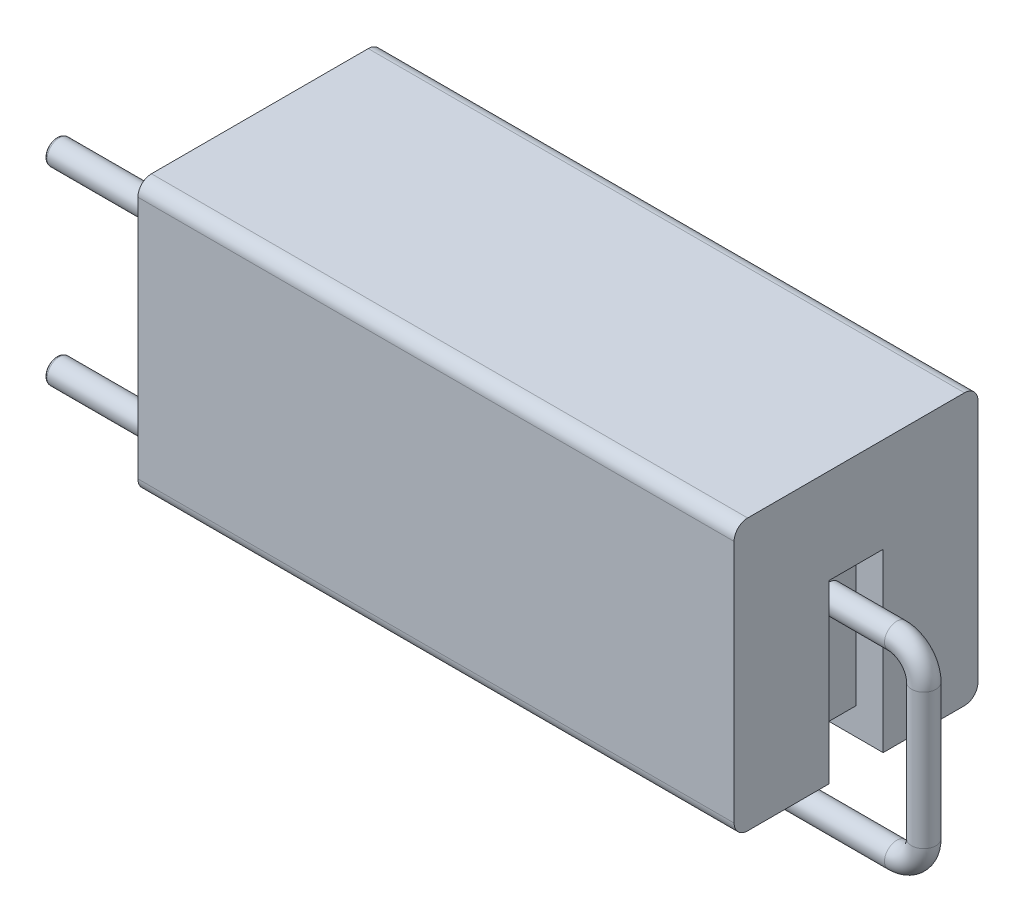
ISO-10303-21;
HEADER;
FILE_DESCRIPTION(('STEP AP214'),'2;1');
FILE_NAME('part.step','',(''),(''),'','','');
FILE_SCHEMA(('AUTOMOTIVE_DESIGN { 1 0 10303 214 1 1 1 1 }'));
ENDSEC;
DATA;
#1=APPLICATION_CONTEXT('core data for automotive mechanical design processes');
#2=APPLICATION_PROTOCOL_DEFINITION('international standard','automotive_design',2000,#1);
#3=PRODUCT_CONTEXT('',#1,'mechanical');
#4=PRODUCT('Part','Part','',(#3));
#5=PRODUCT_RELATED_PRODUCT_CATEGORY('part','',(#4));
#6=PRODUCT_DEFINITION_FORMATION('','',#4);
#7=PRODUCT_DEFINITION_CONTEXT('part definition',#1,'design');
#8=PRODUCT_DEFINITION('design','',#6,#7);
#9=PRODUCT_DEFINITION_SHAPE('','',#8);
#10=(LENGTH_UNIT() NAMED_UNIT(*) SI_UNIT(.MILLI.,.METRE.));
#11=(NAMED_UNIT(*) PLANE_ANGLE_UNIT() SI_UNIT($,.RADIAN.));
#12=(NAMED_UNIT(*) SI_UNIT($,.STERADIAN.) SOLID_ANGLE_UNIT());
#13=UNCERTAINTY_MEASURE_WITH_UNIT(LENGTH_MEASURE(1.E-05),#10,'distance_accuracy_value','');
#14=(GEOMETRIC_REPRESENTATION_CONTEXT(3) GLOBAL_UNCERTAINTY_ASSIGNED_CONTEXT((#13)) GLOBAL_UNIT_ASSIGNED_CONTEXT((#10,
#11,#12)) REPRESENTATION_CONTEXT('',''));
#15=CARTESIAN_POINT('',(0.,0.,0.));
#16=DIRECTION('',(0.,0.,1.));
#17=DIRECTION('',(1.,0.,0.));
#18=AXIS2_PLACEMENT_3D('',#15,#16,#17);
#19=CARTESIAN_POINT('',(0.,-10.,9.));
#20=DIRECTION('',(0.,1.,0.));
#21=DIRECTION('',(0.,0.,1.));
#22=AXIS2_PLACEMENT_3D('',#19,#20,#21);
#23=PLANE('',#22);
#24=DIRECTION('',(-1.,0.,0.));
#25=VECTOR('',#24,1.);
#26=CARTESIAN_POINT('',(1.,-10.,5.5));
#27=LINE('',#26,#25);
#28=CARTESIAN_POINT('',(3.,-10.,5.5));
#29=VERTEX_POINT('',#28);
#30=CARTESIAN_POINT('',(0.,-10.,5.5));
#31=VERTEX_POINT('',#30);
#32=EDGE_CURVE('E257',#29,#31,#27,.T.);
#33=ORIENTED_EDGE('',*,*,#32,.F.);
#34=DIRECTION('',(0.,0.,-1.));
#35=VECTOR('',#34,1.);
#36=CARTESIAN_POINT('',(3.,-10.,8.));
#37=LINE('',#36,#35);
#38=CARTESIAN_POINT('',(3.,-10.,8.));
#39=VERTEX_POINT('',#38);
#40=EDGE_CURVE('E413',#39,#29,#37,.T.);
#41=ORIENTED_EDGE('',*,*,#40,.F.);
#42=DIRECTION('',(-1.,0.,0.));
#43=VECTOR('',#42,1.);
#44=CARTESIAN_POINT('',(3.,-10.,8.));
#45=LINE('',#44,#43);
#46=CARTESIAN_POINT('',(19.,-10.,8.));
#47=VERTEX_POINT('',#46);
#48=EDGE_CURVE('E403',#47,#39,#45,.T.);
#49=ORIENTED_EDGE('',*,*,#48,.F.);
#50=DIRECTION('',(0.,0.,1.));
#51=VECTOR('',#50,1.);
#52=CARTESIAN_POINT('',(19.,-10.,8.));
#53=LINE('',#52,#51);
#54=CARTESIAN_POINT('',(19.,-10.,5.5));
#55=VERTEX_POINT('',#54);
#56=EDGE_CURVE('E397',#55,#47,#53,.T.);
#57=ORIENTED_EDGE('',*,*,#56,.F.);
#58=DIRECTION('',(-1.,0.,0.));
#59=VECTOR('',#58,1.);
#60=CARTESIAN_POINT('',(22.,-10.,5.5));
#61=LINE('',#60,#59);
#62=CARTESIAN_POINT('',(22.,-10.,5.5));
#63=VERTEX_POINT('',#62);
#64=EDGE_CURVE('E291',#63,#55,#61,.T.);
#65=ORIENTED_EDGE('',*,*,#64,.F.);
#66=DIRECTION('',(0.,0.,-1.));
#67=VECTOR('',#66,1.);
#68=CARTESIAN_POINT('',(22.,-10.,9.));
#69=LINE('',#68,#67);
#70=CARTESIAN_POINT('',(22.,-10.,8.5));
#71=VERTEX_POINT('',#70);
#72=EDGE_CURVE('E455',#71,#63,#69,.T.);
#73=ORIENTED_EDGE('',*,*,#72,.F.);
#74=DIRECTION('',(1.,0.,0.));
#75=VECTOR('',#74,1.);
#76=CARTESIAN_POINT('',(0.,-10.,8.5));
#77=LINE('',#76,#75);
#78=CARTESIAN_POINT('',(0.,-10.,8.5));
#79=VERTEX_POINT('',#78);
#80=EDGE_CURVE('E501',#71,#79,#77,.F.);
#81=ORIENTED_EDGE('',*,*,#80,.T.);
#82=DIRECTION('',(0.,0.,-1.));
#83=VECTOR('',#82,1.);
#84=CARTESIAN_POINT('',(0.,-10.,9.));
#85=LINE('',#84,#83);
#86=EDGE_CURVE('E454',#79,#31,#85,.T.);
#87=ORIENTED_EDGE('',*,*,#86,.T.);
#88=EDGE_LOOP('',(#33,#41,#49,#57,#65,#73,#81,#87));
#89=FACE_BOUND('',#88,.T.);
#90=ADVANCED_FACE('F71',(#89),#23,.F.);
#91=CARTESIAN_POINT('',(0.,0.,9.));
#92=DIRECTION('',(1.,0.,0.));
#93=DIRECTION('',(0.,1.,0.));
#94=AXIS2_PLACEMENT_3D('',#91,#92,#93);
#95=PLANE('',#94);
#96=CARTESIAN_POINT('',(0.,-10.,3.5));
#97=VERTEX_POINT('',#96);
#98=CARTESIAN_POINT('',(0.,-10.,0.5));
#99=VERTEX_POINT('',#98);
#100=EDGE_CURVE('E446',#97,#99,#85,.T.);
#101=ORIENTED_EDGE('',*,*,#100,.F.);
#102=DIRECTION('',(0.,-1.,0.));
#103=VECTOR('',#102,1.);
#104=CARTESIAN_POINT('',(0.,-3.5,3.5));
#105=LINE('',#104,#103);
#106=CARTESIAN_POINT('',(0.,-3.5,3.5));
#107=VERTEX_POINT('',#106);
#108=EDGE_CURVE('E278',#107,#97,#105,.T.);
#109=ORIENTED_EDGE('',*,*,#108,.F.);
#110=DIRECTION('',(0.,0.,-1.));
#111=VECTOR('',#110,1.);
#112=CARTESIAN_POINT('',(0.,-3.5,5.5));
#113=LINE('',#112,#111);
#114=CARTESIAN_POINT('',(0.,-3.5,5.5));
#115=VERTEX_POINT('',#114);
#116=EDGE_CURVE('E273',#115,#107,#113,.T.);
#117=ORIENTED_EDGE('',*,*,#116,.F.);
#118=DIRECTION('',(0.,1.,0.));
#119=VECTOR('',#118,1.);
#120=CARTESIAN_POINT('',(0.,-10.,5.5));
#121=LINE('',#120,#119);
#122=EDGE_CURVE('E269',#31,#115,#121,.T.);
#123=ORIENTED_EDGE('',*,*,#122,.F.);
#124=ORIENTED_EDGE('',*,*,#86,.F.);
#125=CARTESIAN_POINT('',(0.,-9.5,8.5));
#126=DIRECTION('',(1.,0.,0.));
#127=DIRECTION('',(0.,1.,0.));
#128=AXIS2_PLACEMENT_3D('',#125,#126,#127);
#129=CIRCLE('',#128,0.5);
#130=CARTESIAN_POINT('',(0.,-9.5,9.));
#131=VERTEX_POINT('',#130);
#132=EDGE_CURVE('E494',#79,#131,#129,.F.);
#133=ORIENTED_EDGE('',*,*,#132,.T.);
#134=DIRECTION('',(0.,-1.,0.));
#135=VECTOR('',#134,1.);
#136=CARTESIAN_POINT('',(0.,0.,9.));
#137=LINE('',#136,#135);
#138=CARTESIAN_POINT('',(0.,-0.5,9.));
#139=VERTEX_POINT('',#138);
#140=EDGE_CURVE('E521',#139,#131,#137,.T.);
#141=ORIENTED_EDGE('',*,*,#140,.F.);
#142=CARTESIAN_POINT('',(0.,-0.5,8.5));
#143=DIRECTION('',(1.,0.,0.));
#144=DIRECTION('',(0.,1.,0.));
#145=AXIS2_PLACEMENT_3D('',#142,#143,#144);
#146=CIRCLE('',#145,0.5);
#147=CARTESIAN_POINT('',(0.,0.,8.5));
#148=VERTEX_POINT('',#147);
#149=EDGE_CURVE('E491',#139,#148,#146,.F.);
#150=ORIENTED_EDGE('',*,*,#149,.T.);
#151=DIRECTION('',(0.,0.,-1.));
#152=VECTOR('',#151,1.);
#153=CARTESIAN_POINT('',(0.,0.,9.));
#154=LINE('',#153,#152);
#155=CARTESIAN_POINT('',(0.,0.,0.5));
#156=VERTEX_POINT('',#155);
#157=EDGE_CURVE('E527',#148,#156,#154,.T.);
#158=ORIENTED_EDGE('',*,*,#157,.T.);
#159=CARTESIAN_POINT('',(0.,-0.5,0.5));
#160=DIRECTION('',(1.,0.,0.));
#161=DIRECTION('',(0.,1.,0.));
#162=AXIS2_PLACEMENT_3D('',#159,#160,#161);
#163=CIRCLE('',#162,0.5);
#164=CARTESIAN_POINT('',(0.,-0.5,0.));
#165=VERTEX_POINT('',#164);
#166=EDGE_CURVE('E498',#156,#165,#163,.F.);
#167=ORIENTED_EDGE('',*,*,#166,.T.);
#168=DIRECTION('',(0.,-1.,0.));
#169=VECTOR('',#168,1.);
#170=CARTESIAN_POINT('',(0.,0.,0.));
#171=LINE('',#170,#169);
#172=CARTESIAN_POINT('',(0.,-9.5,0.));
#173=VERTEX_POINT('',#172);
#174=EDGE_CURVE('E305',#165,#173,#171,.T.);
#175=ORIENTED_EDGE('',*,*,#174,.T.);
#176=CARTESIAN_POINT('',(0.,-9.5,0.5));
#177=DIRECTION('',(1.,0.,0.));
#178=DIRECTION('',(0.,1.,0.));
#179=AXIS2_PLACEMENT_3D('',#176,#177,#178);
#180=CIRCLE('',#179,0.5);
#181=EDGE_CURVE('E451',#173,#99,#180,.F.);
#182=ORIENTED_EDGE('',*,*,#181,.T.);
#183=EDGE_LOOP('',(#101,#109,#117,#123,#124,#133,#141,#150,#158,#167,#175,#182));
#184=FACE_BOUND('',#183,.T.);
#185=ADVANCED_FACE('F358',(#184),#95,.F.);
#186=DIRECTION('',(-1.,0.,0.));
#187=VECTOR('',#186,1.);
#188=CARTESIAN_POINT('',(22.,-10.,3.5));
#189=LINE('',#188,#187);
#190=CARTESIAN_POINT('',(22.,-10.,3.5));
#191=VERTEX_POINT('',#190);
#192=CARTESIAN_POINT('',(19.,-10.,3.5));
#193=VERTEX_POINT('',#192);
#194=EDGE_CURVE('E95',#191,#193,#189,.T.);
#195=ORIENTED_EDGE('',*,*,#194,.T.);
#196=DIRECTION('',(0.,0.,1.));
#197=VECTOR('',#196,1.);
#198=CARTESIAN_POINT('',(19.,-10.,0.999999999999997));
#199=LINE('',#198,#197);
#200=CARTESIAN_POINT('',(19.,-10.,0.999999999999997));
#201=VERTEX_POINT('',#200);
#202=EDGE_CURVE('E380',#201,#193,#199,.T.);
#203=ORIENTED_EDGE('',*,*,#202,.F.);
#204=DIRECTION('',(1.,0.,0.));
#205=VECTOR('',#204,1.);
#206=CARTESIAN_POINT('',(19.,-10.,0.999999999999997));
#207=LINE('',#206,#205);
#208=CARTESIAN_POINT('',(3.,-10.,0.999999999999995));
#209=VERTEX_POINT('',#208);
#210=EDGE_CURVE('E398',#209,#201,#207,.T.);
#211=ORIENTED_EDGE('',*,*,#210,.F.);
#212=DIRECTION('',(0.,0.,-1.));
#213=VECTOR('',#212,1.);
#214=CARTESIAN_POINT('',(3.,-10.,0.999999999999995));
#215=LINE('',#214,#213);
#216=CARTESIAN_POINT('',(3.,-10.,3.5));
#217=VERTEX_POINT('',#216);
#218=EDGE_CURVE('E406',#217,#209,#215,.T.);
#219=ORIENTED_EDGE('',*,*,#218,.F.);
#220=DIRECTION('',(-1.,0.,0.));
#221=VECTOR('',#220,1.);
#222=CARTESIAN_POINT('',(1.,-10.,3.5));
#223=LINE('',#222,#221);
#224=EDGE_CURVE('E281',#217,#97,#223,.T.);
#225=ORIENTED_EDGE('',*,*,#224,.T.);
#226=ORIENTED_EDGE('',*,*,#100,.T.);
#227=DIRECTION('',(1.,0.,0.));
#228=VECTOR('',#227,1.);
#229=CARTESIAN_POINT('',(0.,-10.,0.5));
#230=LINE('',#229,#228);
#231=CARTESIAN_POINT('',(22.,-10.,0.5));
#232=VERTEX_POINT('',#231);
#233=EDGE_CURVE('E503',#99,#232,#230,.T.);
#234=ORIENTED_EDGE('',*,*,#233,.T.);
#235=EDGE_CURVE('E321',#191,#232,#69,.T.);
#236=ORIENTED_EDGE('',*,*,#235,.F.);
#237=EDGE_LOOP('',(#195,#203,#211,#219,#225,#226,#234,#236));
#238=FACE_BOUND('',#237,.T.);
#239=ADVANCED_FACE('F361',(#238),#23,.F.);
#240=CARTESIAN_POINT('',(22.,0.,9.));
#241=DIRECTION('',(1.,0.,0.));
#242=DIRECTION('',(0.,0.,-1.));
#243=AXIS2_PLACEMENT_3D('',#240,#241,#242);
#244=PLANE('',#243);
#245=DIRECTION('',(0.,1.,0.));
#246=VECTOR('',#245,1.);
#247=CARTESIAN_POINT('',(22.,-10.,5.5));
#248=LINE('',#247,#246);
#249=CARTESIAN_POINT('',(22.,-3.5,5.5));
#250=VERTEX_POINT('',#249);
#251=EDGE_CURVE('E294',#63,#250,#248,.T.);
#252=ORIENTED_EDGE('',*,*,#251,.T.);
#253=DIRECTION('',(0.,0.,-1.));
#254=VECTOR('',#253,1.);
#255=CARTESIAN_POINT('',(22.,-3.5,5.5));
#256=LINE('',#255,#254);
#257=CARTESIAN_POINT('',(22.,-3.5,3.5));
#258=VERTEX_POINT('',#257);
#259=EDGE_CURVE('E571',#250,#258,#256,.T.);
#260=ORIENTED_EDGE('',*,*,#259,.T.);
#261=DIRECTION('',(0.,-1.,0.));
#262=VECTOR('',#261,1.);
#263=CARTESIAN_POINT('',(22.,-3.5,3.5));
#264=LINE('',#263,#262);
#265=EDGE_CURVE('E306',#258,#191,#264,.T.);
#266=ORIENTED_EDGE('',*,*,#265,.T.);
#267=ORIENTED_EDGE('',*,*,#235,.T.);
#268=CARTESIAN_POINT('',(22.,-9.5,0.5));
#269=DIRECTION('',(1.,0.,0.));
#270=DIRECTION('',(0.,0.,-1.));
#271=AXIS2_PLACEMENT_3D('',#268,#269,#270);
#272=CIRCLE('',#271,0.5);
#273=CARTESIAN_POINT('',(22.,-9.5,0.));
#274=VERTEX_POINT('',#273);
#275=EDGE_CURVE('E478',#232,#274,#272,.T.);
#276=ORIENTED_EDGE('',*,*,#275,.T.);
#277=DIRECTION('',(0.,-1.,0.));
#278=VECTOR('',#277,1.);
#279=CARTESIAN_POINT('',(22.,0.,0.));
#280=LINE('',#279,#278);
#281=CARTESIAN_POINT('',(22.,-0.5,0.));
#282=VERTEX_POINT('',#281);
#283=EDGE_CURVE('E534',#282,#274,#280,.T.);
#284=ORIENTED_EDGE('',*,*,#283,.F.);
#285=CARTESIAN_POINT('',(22.,-0.5,0.5));
#286=DIRECTION('',(1.,0.,0.));
#287=DIRECTION('',(0.,0.,-1.));
#288=AXIS2_PLACEMENT_3D('',#285,#286,#287);
#289=CIRCLE('',#288,0.5);
#290=CARTESIAN_POINT('',(22.,0.,0.5));
#291=VERTEX_POINT('',#290);
#292=EDGE_CURVE('E481',#282,#291,#289,.T.);
#293=ORIENTED_EDGE('',*,*,#292,.T.);
#294=DIRECTION('',(0.,0.,-1.));
#295=VECTOR('',#294,1.);
#296=CARTESIAN_POINT('',(22.,0.,9.));
#297=LINE('',#296,#295);
#298=CARTESIAN_POINT('',(22.,0.,8.5));
#299=VERTEX_POINT('',#298);
#300=EDGE_CURVE('E532',#299,#291,#297,.T.);
#301=ORIENTED_EDGE('',*,*,#300,.F.);
#302=CARTESIAN_POINT('',(22.,-0.5,8.5));
#303=DIRECTION('',(1.,0.,0.));
#304=DIRECTION('',(0.,0.,-1.));
#305=AXIS2_PLACEMENT_3D('',#302,#303,#304);
#306=CIRCLE('',#305,0.5);
#307=CARTESIAN_POINT('',(22.,-0.5,9.));
#308=VERTEX_POINT('',#307);
#309=EDGE_CURVE('E472',#299,#308,#306,.T.);
#310=ORIENTED_EDGE('',*,*,#309,.T.);
#311=DIRECTION('',(0.,-1.,0.));
#312=VECTOR('',#311,1.);
#313=CARTESIAN_POINT('',(22.,0.,9.));
#314=LINE('',#313,#312);
#315=CARTESIAN_POINT('',(22.,-9.5,9.));
#316=VERTEX_POINT('',#315);
#317=EDGE_CURVE('E518',#308,#316,#314,.T.);
#318=ORIENTED_EDGE('',*,*,#317,.T.);
#319=CARTESIAN_POINT('',(22.,-9.5,8.5));
#320=DIRECTION('',(1.,0.,0.));
#321=DIRECTION('',(0.,0.,-1.));
#322=AXIS2_PLACEMENT_3D('',#319,#320,#321);
#323=CIRCLE('',#322,0.5);
#324=EDGE_CURVE('E475',#316,#71,#323,.T.);
#325=ORIENTED_EDGE('',*,*,#324,.T.);
#326=ORIENTED_EDGE('',*,*,#72,.T.);
#327=EDGE_LOOP('',(#252,#260,#266,#267,#276,#284,#293,#301,#310,#318,#325,#326));
#328=FACE_BOUND('',#327,.T.);
#329=ADVANCED_FACE('F369',(#328),#244,.T.);
#330=CARTESIAN_POINT('',(0.,0.,9.));
#331=DIRECTION('',(0.,1.,0.));
#332=DIRECTION('',(0.,0.,1.));
#333=AXIS2_PLACEMENT_3D('',#330,#331,#332);
#334=PLANE('',#333);
#335=ORIENTED_EDGE('',*,*,#300,.T.);
#336=DIRECTION('',(1.,0.,0.));
#337=VECTOR('',#336,1.);
#338=CARTESIAN_POINT('',(0.,0.,0.5));
#339=LINE('',#338,#337);
#340=EDGE_CURVE('E488',#291,#156,#339,.F.);
#341=ORIENTED_EDGE('',*,*,#340,.T.);
#342=ORIENTED_EDGE('',*,*,#157,.F.);
#343=DIRECTION('',(1.,0.,0.));
#344=VECTOR('',#343,1.);
#345=CARTESIAN_POINT('',(0.,0.,8.5));
#346=LINE('',#345,#344);
#347=EDGE_CURVE('E484',#148,#299,#346,.T.);
#348=ORIENTED_EDGE('',*,*,#347,.T.);
#349=EDGE_LOOP('',(#335,#341,#342,#348));
#350=FACE_BOUND('',#349,.T.);
#351=ADVANCED_FACE('F374',(#350),#334,.T.);
#352=CARTESIAN_POINT('',(0.,0.,9.));
#353=DIRECTION('',(0.,0.,1.));
#354=DIRECTION('',(1.,0.,0.));
#355=AXIS2_PLACEMENT_3D('',#352,#353,#354);
#356=PLANE('',#355);
#357=ORIENTED_EDGE('',*,*,#140,.T.);
#358=DIRECTION('',(1.,0.,0.));
#359=VECTOR('',#358,1.);
#360=CARTESIAN_POINT('',(22.,-9.5,9.));
#361=LINE('',#360,#359);
#362=EDGE_CURVE('E329',#131,#316,#361,.T.);
#363=ORIENTED_EDGE('',*,*,#362,.T.);
#364=ORIENTED_EDGE('',*,*,#317,.F.);
#365=DIRECTION('',(1.,0.,0.));
#366=VECTOR('',#365,1.);
#367=CARTESIAN_POINT('',(0.,-0.5,9.));
#368=LINE('',#367,#366);
#369=EDGE_CURVE('E506',#308,#139,#368,.F.);
#370=ORIENTED_EDGE('',*,*,#369,.T.);
#371=EDGE_LOOP('',(#357,#363,#364,#370));
#372=FACE_BOUND('',#371,.T.);
#373=ADVANCED_FACE('F517',(#372),#356,.T.);
#374=CARTESIAN_POINT('',(0.,0.,0.));
#375=DIRECTION('',(0.,0.,1.));
#376=DIRECTION('',(1.,0.,0.));
#377=AXIS2_PLACEMENT_3D('',#374,#375,#376);
#378=PLANE('',#377);
#379=ORIENTED_EDGE('',*,*,#174,.F.);
#380=DIRECTION('',(1.,0.,0.));
#381=VECTOR('',#380,1.);
#382=CARTESIAN_POINT('',(22.,-0.5,0.));
#383=LINE('',#382,#381);
#384=EDGE_CURVE('E469',#165,#282,#383,.T.);
#385=ORIENTED_EDGE('',*,*,#384,.T.);
#386=ORIENTED_EDGE('',*,*,#283,.T.);
#387=DIRECTION('',(1.,0.,0.));
#388=VECTOR('',#387,1.);
#389=CARTESIAN_POINT('',(0.,-9.5,0.));
#390=LINE('',#389,#388);
#391=EDGE_CURVE('E461',#274,#173,#390,.F.);
#392=ORIENTED_EDGE('',*,*,#391,.T.);
#393=EDGE_LOOP('',(#379,#385,#386,#392));
#394=FACE_BOUND('',#393,.T.);
#395=ADVANCED_FACE('F556',(#394),#378,.F.);
#396=CARTESIAN_POINT('',(0.,-0.5,0.5));
#397=DIRECTION('',(-1.,0.,0.));
#398=DIRECTION('',(0.,0.,1.));
#399=AXIS2_PLACEMENT_3D('',#396,#397,#398);
#400=CYLINDRICAL_SURFACE('',#399,0.5);
#401=ORIENTED_EDGE('',*,*,#166,.F.);
#402=ORIENTED_EDGE('',*,*,#340,.F.);
#403=ORIENTED_EDGE('',*,*,#292,.F.);
#404=ORIENTED_EDGE('',*,*,#384,.F.);
#405=EDGE_LOOP('',(#401,#402,#403,#404));
#406=FACE_BOUND('',#405,.T.);
#407=ADVANCED_FACE('F561',(#406),#400,.T.);
#408=CARTESIAN_POINT('',(0.,-9.5,0.5));
#409=DIRECTION('',(1.,0.,0.));
#410=DIRECTION('',(0.,0.,-1.));
#411=AXIS2_PLACEMENT_3D('',#408,#409,#410);
#412=CYLINDRICAL_SURFACE('',#411,0.5);
#413=ORIENTED_EDGE('',*,*,#181,.F.);
#414=ORIENTED_EDGE('',*,*,#391,.F.);
#415=ORIENTED_EDGE('',*,*,#275,.F.);
#416=ORIENTED_EDGE('',*,*,#233,.F.);
#417=EDGE_LOOP('',(#413,#414,#415,#416));
#418=FACE_BOUND('',#417,.T.);
#419=ADVANCED_FACE('F553',(#418),#412,.T.);
#420=CARTESIAN_POINT('',(0.,-9.5,8.5));
#421=DIRECTION('',(-1.,0.,0.));
#422=DIRECTION('',(0.,0.,1.));
#423=AXIS2_PLACEMENT_3D('',#420,#421,#422);
#424=CYLINDRICAL_SURFACE('',#423,0.5);
#425=ORIENTED_EDGE('',*,*,#132,.F.);
#426=ORIENTED_EDGE('',*,*,#80,.F.);
#427=ORIENTED_EDGE('',*,*,#324,.F.);
#428=ORIENTED_EDGE('',*,*,#362,.F.);
#429=EDGE_LOOP('',(#425,#426,#427,#428));
#430=FACE_BOUND('',#429,.T.);
#431=ADVANCED_FACE('F568',(#430),#424,.T.);
#432=CARTESIAN_POINT('',(0.,-0.5,8.5));
#433=DIRECTION('',(1.,0.,0.));
#434=DIRECTION('',(0.,0.,-1.));
#435=AXIS2_PLACEMENT_3D('',#432,#433,#434);
#436=CYLINDRICAL_SURFACE('',#435,0.5);
#437=ORIENTED_EDGE('',*,*,#149,.F.);
#438=ORIENTED_EDGE('',*,*,#369,.F.);
#439=ORIENTED_EDGE('',*,*,#309,.F.);
#440=ORIENTED_EDGE('',*,*,#347,.F.);
#441=EDGE_LOOP('',(#437,#438,#439,#440));
#442=FACE_BOUND('',#441,.T.);
#443=ADVANCED_FACE('F565',(#442),#436,.T.);
#444=CARTESIAN_POINT('',(21.,0.,0.));
#445=DIRECTION('',(1.,0.,0.));
#446=DIRECTION('',(0.,0.,-1.));
#447=AXIS2_PLACEMENT_3D('',#444,#445,#446);
#448=PLANE('',#447);
#449=CARTESIAN_POINT('',(21.,-5.,4.5));
#450=DIRECTION('',(1.,0.,0.));
#451=DIRECTION('',(0.,0.,-1.));
#452=AXIS2_PLACEMENT_3D('',#449,#450,#451);
#453=CIRCLE('',#452,0.45);
#454=CARTESIAN_POINT('',(21.,-5.,4.05));
#455=VERTEX_POINT('',#454);
#456=EDGE_CURVE('E324',#455,#455,#453,.T.);
#457=ORIENTED_EDGE('',*,*,#456,.F.);
#458=EDGE_LOOP('',(#457));
#459=FACE_BOUND('',#458,.T.);
#460=DIRECTION('',(0.,0.,1.));
#461=VECTOR('',#460,1.);
#462=CARTESIAN_POINT('',(21.,-9.,5.5));
#463=LINE('',#462,#461);
#464=CARTESIAN_POINT('',(21.,-9.,3.5));
#465=VERTEX_POINT('',#464);
#466=CARTESIAN_POINT('',(21.,-9.,5.5));
#467=VERTEX_POINT('',#466);
#468=EDGE_CURVE('E605',#465,#467,#463,.T.);
#469=ORIENTED_EDGE('',*,*,#468,.F.);
#470=DIRECTION('',(0.,-1.,0.));
#471=VECTOR('',#470,1.);
#472=CARTESIAN_POINT('',(21.,-3.5,3.5));
#473=LINE('',#472,#471);
#474=CARTESIAN_POINT('',(21.,-3.5,3.5));
#475=VERTEX_POINT('',#474);
#476=EDGE_CURVE('E311',#475,#465,#473,.T.);
#477=ORIENTED_EDGE('',*,*,#476,.F.);
#478=DIRECTION('',(0.,0.,-1.));
#479=VECTOR('',#478,1.);
#480=CARTESIAN_POINT('',(21.,-3.5,5.5));
#481=LINE('',#480,#479);
#482=CARTESIAN_POINT('',(21.,-3.5,5.5));
#483=VERTEX_POINT('',#482);
#484=EDGE_CURVE('E580',#483,#475,#481,.T.);
#485=ORIENTED_EDGE('',*,*,#484,.F.);
#486=DIRECTION('',(0.,1.,0.));
#487=VECTOR('',#486,1.);
#488=CARTESIAN_POINT('',(21.,-10.,5.5));
#489=LINE('',#488,#487);
#490=EDGE_CURVE('E285',#467,#483,#489,.T.);
#491=ORIENTED_EDGE('',*,*,#490,.F.);
#492=EDGE_LOOP('',(#469,#477,#485,#491));
#493=FACE_BOUND('',#492,.T.);
#494=ADVANCED_FACE('F603',(#459,#493),#448,.T.);
#495=CARTESIAN_POINT('',(22.,-10.,5.5));
#496=DIRECTION('',(0.,0.,1.));
#497=DIRECTION('',(1.,0.,0.));
#498=AXIS2_PLACEMENT_3D('',#495,#496,#497);
#499=PLANE('',#498);
#500=ORIENTED_EDGE('',*,*,#64,.T.);
#501=DIRECTION('',(0.,-1.,0.));
#502=VECTOR('',#501,1.);
#503=CARTESIAN_POINT('',(19.,-9.,5.5));
#504=LINE('',#503,#502);
#505=CARTESIAN_POINT('',(19.,-9.,5.5));
#506=VERTEX_POINT('',#505);
#507=EDGE_CURVE('E391',#506,#55,#504,.T.);
#508=ORIENTED_EDGE('',*,*,#507,.F.);
#509=DIRECTION('',(-1.,0.,0.));
#510=VECTOR('',#509,1.);
#511=CARTESIAN_POINT('',(19.,-9.,5.5));
#512=LINE('',#511,#510);
#513=EDGE_CURVE('E607',#467,#506,#512,.T.);
#514=ORIENTED_EDGE('',*,*,#513,.F.);
#515=ORIENTED_EDGE('',*,*,#490,.T.);
#516=DIRECTION('',(-1.,0.,0.));
#517=VECTOR('',#516,1.);
#518=CARTESIAN_POINT('',(22.,-3.5,5.5));
#519=LINE('',#518,#517);
#520=EDGE_CURVE('E300',#250,#483,#519,.T.);
#521=ORIENTED_EDGE('',*,*,#520,.F.);
#522=ORIENTED_EDGE('',*,*,#251,.F.);
#523=EDGE_LOOP('',(#500,#508,#514,#515,#521,#522));
#524=FACE_BOUND('',#523,.T.);
#525=ADVANCED_FACE('F574',(#524),#499,.F.);
#526=CARTESIAN_POINT('',(22.,-3.5,5.5));
#527=DIRECTION('',(0.,1.,0.));
#528=DIRECTION('',(0.,0.,1.));
#529=AXIS2_PLACEMENT_3D('',#526,#527,#528);
#530=PLANE('',#529);
#531=ORIENTED_EDGE('',*,*,#484,.T.);
#532=DIRECTION('',(-1.,0.,0.));
#533=VECTOR('',#532,1.);
#534=CARTESIAN_POINT('',(22.,-3.5,3.5));
#535=LINE('',#534,#533);
#536=EDGE_CURVE('E591',#258,#475,#535,.T.);
#537=ORIENTED_EDGE('',*,*,#536,.F.);
#538=ORIENTED_EDGE('',*,*,#259,.F.);
#539=ORIENTED_EDGE('',*,*,#520,.T.);
#540=EDGE_LOOP('',(#531,#537,#538,#539));
#541=FACE_BOUND('',#540,.T.);
#542=ADVANCED_FACE('F673',(#541),#530,.F.);
#543=CARTESIAN_POINT('',(22.,-3.5,3.5));
#544=DIRECTION('',(0.,0.,-1.));
#545=DIRECTION('',(0.,1.,0.));
#546=AXIS2_PLACEMENT_3D('',#543,#544,#545);
#547=PLANE('',#546);
#548=ORIENTED_EDGE('',*,*,#476,.T.);
#549=DIRECTION('',(1.,0.,0.));
#550=VECTOR('',#549,1.);
#551=CARTESIAN_POINT('',(21.,-9.,3.5));
#552=LINE('',#551,#550);
#553=CARTESIAN_POINT('',(19.,-9.,3.5));
#554=VERTEX_POINT('',#553);
#555=EDGE_CURVE('E386',#554,#465,#552,.T.);
#556=ORIENTED_EDGE('',*,*,#555,.F.);
#557=DIRECTION('',(0.,-1.,0.));
#558=VECTOR('',#557,1.);
#559=CARTESIAN_POINT('',(19.,-9.,3.5));
#560=LINE('',#559,#558);
#561=EDGE_CURVE('E383',#554,#193,#560,.T.);
#562=ORIENTED_EDGE('',*,*,#561,.T.);
#563=ORIENTED_EDGE('',*,*,#194,.F.);
#564=ORIENTED_EDGE('',*,*,#265,.F.);
#565=ORIENTED_EDGE('',*,*,#536,.T.);
#566=EDGE_LOOP('',(#548,#556,#562,#563,#564,#565));
#567=FACE_BOUND('',#566,.T.);
#568=ADVANCED_FACE('F385',(#567),#547,.F.);
#569=CARTESIAN_POINT('',(1.,-3.5,3.5));
#570=DIRECTION('',(0.,0.,-1.));
#571=DIRECTION('',(0.,1.,0.));
#572=AXIS2_PLACEMENT_3D('',#569,#570,#571);
#573=PLANE('',#572);
#574=ORIENTED_EDGE('',*,*,#108,.T.);
#575=ORIENTED_EDGE('',*,*,#224,.F.);
#576=DIRECTION('',(0.,-1.,0.));
#577=VECTOR('',#576,1.);
#578=CARTESIAN_POINT('',(3.,-9.,3.5));
#579=LINE('',#578,#577);
#580=CARTESIAN_POINT('',(3.,-9.,3.5));
#581=VERTEX_POINT('',#580);
#582=EDGE_CURVE('E240',#581,#217,#579,.T.);
#583=ORIENTED_EDGE('',*,*,#582,.F.);
#584=DIRECTION('',(1.,0.,0.));
#585=VECTOR('',#584,1.);
#586=CARTESIAN_POINT('',(1.,-9.,3.5));
#587=LINE('',#586,#585);
#588=CARTESIAN_POINT('',(1.,-9.,3.5));
#589=VERTEX_POINT('',#588);
#590=EDGE_CURVE('E235',#589,#581,#587,.T.);
#591=ORIENTED_EDGE('',*,*,#590,.F.);
#592=DIRECTION('',(0.,-1.,0.));
#593=VECTOR('',#592,1.);
#594=CARTESIAN_POINT('',(1.,-3.5,3.5));
#595=LINE('',#594,#593);
#596=CARTESIAN_POINT('',(1.,-3.5,3.5));
#597=VERTEX_POINT('',#596);
#598=EDGE_CURVE('E238',#597,#589,#595,.T.);
#599=ORIENTED_EDGE('',*,*,#598,.F.);
#600=DIRECTION('',(-1.,0.,0.));
#601=VECTOR('',#600,1.);
#602=CARTESIAN_POINT('',(1.,-3.5,3.5));
#603=LINE('',#602,#601);
#604=EDGE_CURVE('E286',#597,#107,#603,.T.);
#605=ORIENTED_EDGE('',*,*,#604,.T.);
#606=EDGE_LOOP('',(#574,#575,#583,#591,#599,#605));
#607=FACE_BOUND('',#606,.T.);
#608=ADVANCED_FACE('F236',(#607),#573,.F.);
#609=CARTESIAN_POINT('',(1.,-3.5,5.5));
#610=DIRECTION('',(0.,1.,0.));
#611=DIRECTION('',(-1.,0.,0.));
#612=AXIS2_PLACEMENT_3D('',#609,#610,#611);
#613=PLANE('',#612);
#614=ORIENTED_EDGE('',*,*,#116,.T.);
#615=ORIENTED_EDGE('',*,*,#604,.F.);
#616=DIRECTION('',(0.,0.,-1.));
#617=VECTOR('',#616,1.);
#618=CARTESIAN_POINT('',(1.,-3.5,5.5));
#619=LINE('',#618,#617);
#620=CARTESIAN_POINT('',(1.,-3.5,5.5));
#621=VERTEX_POINT('',#620);
#622=EDGE_CURVE('E255',#621,#597,#619,.T.);
#623=ORIENTED_EDGE('',*,*,#622,.F.);
#624=DIRECTION('',(-1.,0.,0.));
#625=VECTOR('',#624,1.);
#626=CARTESIAN_POINT('',(1.,-3.5,5.5));
#627=LINE('',#626,#625);
#628=EDGE_CURVE('E262',#621,#115,#627,.T.);
#629=ORIENTED_EDGE('',*,*,#628,.T.);
#630=EDGE_LOOP('',(#614,#615,#623,#629));
#631=FACE_BOUND('',#630,.T.);
#632=ADVANCED_FACE('F442',(#631),#613,.F.);
#633=CARTESIAN_POINT('',(1.,-10.,5.5));
#634=DIRECTION('',(0.,0.,1.));
#635=DIRECTION('',(1.,0.,0.));
#636=AXIS2_PLACEMENT_3D('',#633,#634,#635);
#637=PLANE('',#636);
#638=ORIENTED_EDGE('',*,*,#122,.T.);
#639=ORIENTED_EDGE('',*,*,#628,.F.);
#640=DIRECTION('',(0.,1.,0.));
#641=VECTOR('',#640,1.);
#642=CARTESIAN_POINT('',(1.,-10.,5.5));
#643=LINE('',#642,#641);
#644=CARTESIAN_POINT('',(1.,-9.,5.5));
#645=VERTEX_POINT('',#644);
#646=EDGE_CURVE('E265',#645,#621,#643,.T.);
#647=ORIENTED_EDGE('',*,*,#646,.F.);
#648=DIRECTION('',(-1.,0.,0.));
#649=VECTOR('',#648,1.);
#650=CARTESIAN_POINT('',(1.,-9.,5.5));
#651=LINE('',#650,#649);
#652=CARTESIAN_POINT('',(3.,-9.,5.5));
#653=VERTEX_POINT('',#652);
#654=EDGE_CURVE('E87',#653,#645,#651,.T.);
#655=ORIENTED_EDGE('',*,*,#654,.F.);
#656=DIRECTION('',(0.,-1.,0.));
#657=VECTOR('',#656,1.);
#658=CARTESIAN_POINT('',(3.,-9.,5.5));
#659=LINE('',#658,#657);
#660=EDGE_CURVE('E274',#653,#29,#659,.T.);
#661=ORIENTED_EDGE('',*,*,#660,.T.);
#662=ORIENTED_EDGE('',*,*,#32,.T.);
#663=EDGE_LOOP('',(#638,#639,#647,#655,#661,#662));
#664=FACE_BOUND('',#663,.T.);
#665=ADVANCED_FACE('F438',(#664),#637,.F.);
#666=CARTESIAN_POINT('',(1.,0.,0.));
#667=DIRECTION('',(-1.,0.,0.));
#668=DIRECTION('',(0.,-1.,0.));
#669=AXIS2_PLACEMENT_3D('',#666,#667,#668);
#670=PLANE('',#669);
#671=CARTESIAN_POINT('',(1.,-5.,4.5));
#672=DIRECTION('',(-1.,0.,0.));
#673=DIRECTION('',(0.,-1.,0.));
#674=AXIS2_PLACEMENT_3D('',#671,#672,#673);
#675=CIRCLE('',#674,0.45);
#676=CARTESIAN_POINT('',(1.,-5.45,4.5));
#677=VERTEX_POINT('',#676);
#678=EDGE_CURVE('E328',#677,#677,#675,.T.);
#679=ORIENTED_EDGE('',*,*,#678,.F.);
#680=EDGE_LOOP('',(#679));
#681=FACE_BOUND('',#680,.T.);
#682=DIRECTION('',(0.,0.,-1.));
#683=VECTOR('',#682,1.);
#684=CARTESIAN_POINT('',(1.,-9.,5.5));
#685=LINE('',#684,#683);
#686=EDGE_CURVE('E245',#645,#589,#685,.T.);
#687=ORIENTED_EDGE('',*,*,#686,.F.);
#688=ORIENTED_EDGE('',*,*,#646,.T.);
#689=ORIENTED_EDGE('',*,*,#622,.T.);
#690=ORIENTED_EDGE('',*,*,#598,.T.);
#691=EDGE_LOOP('',(#687,#688,#689,#690));
#692=FACE_BOUND('',#691,.T.);
#693=ADVANCED_FACE('F253',(#681,#692),#670,.T.);
#694=CARTESIAN_POINT('',(3.,-9.,8.));
#695=DIRECTION('',(-1.,0.,0.));
#696=DIRECTION('',(0.,0.,1.));
#697=AXIS2_PLACEMENT_3D('',#694,#695,#696);
#698=PLANE('',#697);
#699=ORIENTED_EDGE('',*,*,#40,.T.);
#700=ORIENTED_EDGE('',*,*,#660,.F.);
#701=DIRECTION('',(0.,0.,-1.));
#702=VECTOR('',#701,1.);
#703=CARTESIAN_POINT('',(3.,-9.,8.));
#704=LINE('',#703,#702);
#705=CARTESIAN_POINT('',(3.,-9.,8.));
#706=VERTEX_POINT('',#705);
#707=EDGE_CURVE('E434',#706,#653,#704,.T.);
#708=ORIENTED_EDGE('',*,*,#707,.F.);
#709=DIRECTION('',(0.,-1.,0.));
#710=VECTOR('',#709,1.);
#711=CARTESIAN_POINT('',(3.,-9.,8.));
#712=LINE('',#711,#710);
#713=EDGE_CURVE('E419',#706,#39,#712,.T.);
#714=ORIENTED_EDGE('',*,*,#713,.T.);
#715=EDGE_LOOP('',(#699,#700,#708,#714));
#716=FACE_BOUND('',#715,.T.);
#717=ADVANCED_FACE('F663',(#716),#698,.F.);
#718=CARTESIAN_POINT('',(3.,-9.,8.));
#719=DIRECTION('',(0.,0.,1.));
#720=DIRECTION('',(1.,0.,0.));
#721=AXIS2_PLACEMENT_3D('',#718,#719,#720);
#722=PLANE('',#721);
#723=ORIENTED_EDGE('',*,*,#48,.T.);
#724=ORIENTED_EDGE('',*,*,#713,.F.);
#725=DIRECTION('',(-1.,0.,0.));
#726=VECTOR('',#725,1.);
#727=CARTESIAN_POINT('',(3.,-9.,8.));
#728=LINE('',#727,#726);
#729=CARTESIAN_POINT('',(19.,-9.,8.));
#730=VERTEX_POINT('',#729);
#731=EDGE_CURVE('E619',#730,#706,#728,.T.);
#732=ORIENTED_EDGE('',*,*,#731,.F.);
#733=DIRECTION('',(0.,-1.,0.));
#734=VECTOR('',#733,1.);
#735=CARTESIAN_POINT('',(19.,-9.,8.));
#736=LINE('',#735,#734);
#737=EDGE_CURVE('E422',#730,#47,#736,.T.);
#738=ORIENTED_EDGE('',*,*,#737,.T.);
#739=EDGE_LOOP('',(#723,#724,#732,#738));
#740=FACE_BOUND('',#739,.T.);
#741=ADVANCED_FACE('F745',(#740),#722,.F.);
#742=CARTESIAN_POINT('',(19.,-9.,8.));
#743=DIRECTION('',(1.,0.,0.));
#744=DIRECTION('',(0.,0.,-1.));
#745=AXIS2_PLACEMENT_3D('',#742,#743,#744);
#746=PLANE('',#745);
#747=ORIENTED_EDGE('',*,*,#56,.T.);
#748=ORIENTED_EDGE('',*,*,#737,.F.);
#749=DIRECTION('',(0.,0.,1.));
#750=VECTOR('',#749,1.);
#751=CARTESIAN_POINT('',(19.,-9.,8.));
#752=LINE('',#751,#750);
#753=EDGE_CURVE('E609',#506,#730,#752,.T.);
#754=ORIENTED_EDGE('',*,*,#753,.F.);
#755=ORIENTED_EDGE('',*,*,#507,.T.);
#756=EDGE_LOOP('',(#747,#748,#754,#755));
#757=FACE_BOUND('',#756,.T.);
#758=ADVANCED_FACE('F752',(#757),#746,.F.);
#759=CARTESIAN_POINT('',(19.,-9.,0.999999999999997));
#760=DIRECTION('',(1.,0.,0.));
#761=DIRECTION('',(0.,0.,-1.));
#762=AXIS2_PLACEMENT_3D('',#759,#760,#761);
#763=PLANE('',#762);
#764=ORIENTED_EDGE('',*,*,#202,.T.);
#765=ORIENTED_EDGE('',*,*,#561,.F.);
#766=DIRECTION('',(0.,0.,1.));
#767=VECTOR('',#766,1.);
#768=CARTESIAN_POINT('',(19.,-9.,0.999999999999997));
#769=LINE('',#768,#767);
#770=CARTESIAN_POINT('',(19.,-9.,0.999999999999997));
#771=VERTEX_POINT('',#770);
#772=EDGE_CURVE('E612',#771,#554,#769,.T.);
#773=ORIENTED_EDGE('',*,*,#772,.F.);
#774=DIRECTION('',(0.,-1.,0.));
#775=VECTOR('',#774,1.);
#776=CARTESIAN_POINT('',(19.,-9.,0.999999999999997));
#777=LINE('',#776,#775);
#778=EDGE_CURVE('E392',#771,#201,#777,.T.);
#779=ORIENTED_EDGE('',*,*,#778,.T.);
#780=EDGE_LOOP('',(#764,#765,#773,#779));
#781=FACE_BOUND('',#780,.T.);
#782=ADVANCED_FACE('F394',(#781),#763,.F.);
#783=CARTESIAN_POINT('',(19.,-9.,0.999999999999997));
#784=DIRECTION('',(0.,0.,-1.));
#785=DIRECTION('',(-1.,0.,0.));
#786=AXIS2_PLACEMENT_3D('',#783,#784,#785);
#787=PLANE('',#786);
#788=ORIENTED_EDGE('',*,*,#210,.T.);
#789=ORIENTED_EDGE('',*,*,#778,.F.);
#790=DIRECTION('',(1.,0.,0.));
#791=VECTOR('',#790,1.);
#792=CARTESIAN_POINT('',(19.,-9.,0.999999999999997));
#793=LINE('',#792,#791);
#794=CARTESIAN_POINT('',(3.,-9.,0.999999999999995));
#795=VERTEX_POINT('',#794);
#796=EDGE_CURVE('E641',#795,#771,#793,.T.);
#797=ORIENTED_EDGE('',*,*,#796,.F.);
#798=DIRECTION('',(0.,-1.,0.));
#799=VECTOR('',#798,1.);
#800=CARTESIAN_POINT('',(3.,-9.,0.999999999999995));
#801=LINE('',#800,#799);
#802=EDGE_CURVE('E430',#795,#209,#801,.T.);
#803=ORIENTED_EDGE('',*,*,#802,.T.);
#804=EDGE_LOOP('',(#788,#789,#797,#803));
#805=FACE_BOUND('',#804,.T.);
#806=ADVANCED_FACE('F647',(#805),#787,.F.);
#807=CARTESIAN_POINT('',(3.,-9.,0.999999999999995));
#808=DIRECTION('',(-1.,0.,0.));
#809=DIRECTION('',(0.,0.,1.));
#810=AXIS2_PLACEMENT_3D('',#807,#808,#809);
#811=PLANE('',#810);
#812=ORIENTED_EDGE('',*,*,#218,.T.);
#813=ORIENTED_EDGE('',*,*,#802,.F.);
#814=DIRECTION('',(0.,0.,-1.));
#815=VECTOR('',#814,1.);
#816=CARTESIAN_POINT('',(3.,-9.,0.999999999999995));
#817=LINE('',#816,#815);
#818=EDGE_CURVE('E244',#581,#795,#817,.T.);
#819=ORIENTED_EDGE('',*,*,#818,.F.);
#820=ORIENTED_EDGE('',*,*,#582,.T.);
#821=EDGE_LOOP('',(#812,#813,#819,#820));
#822=FACE_BOUND('',#821,.T.);
#823=ADVANCED_FACE('F648',(#822),#811,.F.);
#824=CARTESIAN_POINT('',(0.,-9.,0.));
#825=DIRECTION('',(0.,1.,0.));
#826=DIRECTION('',(0.,0.,1.));
#827=AXIS2_PLACEMENT_3D('',#824,#825,#826);
#828=PLANE('',#827);
#829=ORIENTED_EDGE('',*,*,#654,.T.);
#830=ORIENTED_EDGE('',*,*,#686,.T.);
#831=ORIENTED_EDGE('',*,*,#590,.T.);
#832=ORIENTED_EDGE('',*,*,#818,.T.);
#833=ORIENTED_EDGE('',*,*,#796,.T.);
#834=ORIENTED_EDGE('',*,*,#772,.T.);
#835=ORIENTED_EDGE('',*,*,#555,.T.);
#836=ORIENTED_EDGE('',*,*,#468,.T.);
#837=ORIENTED_EDGE('',*,*,#513,.T.);
#838=ORIENTED_EDGE('',*,*,#753,.T.);
#839=ORIENTED_EDGE('',*,*,#731,.T.);
#840=ORIENTED_EDGE('',*,*,#707,.T.);
#841=EDGE_LOOP('',(#829,#830,#831,#832,#833,#834,#835,#836,#837,#838,#839,#840));
#842=FACE_BOUND('',#841,.T.);
#843=ADVANCED_FACE('F247',(#842),#828,.F.);
#844=CARTESIAN_POINT('',(-7.5,-12.,4.5));
#845=DIRECTION('',(-1.,0.,0.));
#846=DIRECTION('',(0.,0.,-1.));
#847=AXIS2_PLACEMENT_3D('',#844,#845,#846);
#848=PLANE('',#847);
#849=CARTESIAN_POINT('',(-7.5,-12.,4.5));
#850=DIRECTION('',(-1.,0.,0.));
#851=DIRECTION('',(0.,-1.,0.));
#852=AXIS2_PLACEMENT_3D('',#849,#850,#851);
#853=CIRCLE('',#852,0.35);
#854=CARTESIAN_POINT('',(-7.5,-12.35,4.5));
#855=VERTEX_POINT('',#854);
#856=EDGE_CURVE('E333',#855,#855,#853,.T.);
#857=ORIENTED_EDGE('',*,*,#856,.T.);
#858=EDGE_LOOP('',(#857));
#859=FACE_BOUND('',#858,.T.);
#860=ADVANCED_FACE('F655',(#859),#848,.T.);
#861=CARTESIAN_POINT('',(21.,-5.,4.5));
#862=DIRECTION('',(1.,0.,0.));
#863=DIRECTION('',(0.,0.,-1.));
#864=AXIS2_PLACEMENT_3D('',#861,#862,#863);
#865=CYLINDRICAL_SURFACE('',#864,0.45);
#866=CARTESIAN_POINT('',(23.5,-5.,4.5));
#867=DIRECTION('',(1.,0.,0.));
#868=DIRECTION('',(0.,0.,-1.));
#869=AXIS2_PLACEMENT_3D('',#866,#867,#868);
#870=CIRCLE('',#869,0.45);
#871=CARTESIAN_POINT('',(23.5,-4.55,4.5));
#872=VERTEX_POINT('',#871);
#873=EDGE_CURVE('E1037',#872,#872,#870,.T.);
#874=ORIENTED_EDGE('',*,*,#873,.F.);
#875=EDGE_LOOP('',(#874));
#876=FACE_BOUND('',#875,.T.);
#877=ORIENTED_EDGE('',*,*,#456,.T.);
#878=EDGE_LOOP('',(#877));
#879=FACE_BOUND('',#878,.T.);
#880=ADVANCED_FACE('F784',(#876,#879),#865,.T.);
#881=CARTESIAN_POINT('',(23.5,-6.,4.5));
#882=DIRECTION('',(0.,0.,-1.));
#883=DIRECTION('',(-1.,0.,0.));
#884=AXIS2_PLACEMENT_3D('',#881,#882,#883);
#885=TOROIDAL_SURFACE('',#884,1.,0.45);
#886=CARTESIAN_POINT('',(24.5,-6.,4.5));
#887=DIRECTION('',(0.,-1.,0.));
#888=DIRECTION('',(0.,0.,-1.));
#889=AXIS2_PLACEMENT_3D('',#886,#887,#888);
#890=CIRCLE('',#889,0.45);
#891=CARTESIAN_POINT('',(24.95,-6.,4.5));
#892=VERTEX_POINT('',#891);
#893=EDGE_CURVE('E634',#892,#892,#890,.T.);
#894=CARTESIAN_POINT('',(23.5,-6.,4.5));
#895=DIRECTION('',(0.,0.,-1.));
#896=DIRECTION('',(-1.,0.,0.));
#897=AXIS2_PLACEMENT_3D('',#894,#895,#896);
#898=CIRCLE('',#897,1.45);
#899=EDGE_CURVE('',#872,#892,#898,.T.);
#900=ORIENTED_EDGE('',*,*,#873,.T.);
#901=ORIENTED_EDGE('',*,*,#893,.F.);
#902=ORIENTED_EDGE('',*,*,#899,.T.);
#903=ORIENTED_EDGE('',*,*,#899,.F.);
#904=EDGE_LOOP('',(#900,#902,#901,#903));
#905=FACE_BOUND('',#904,.T.);
#906=ADVANCED_FACE('F795',(#905),#885,.T.);
#907=CARTESIAN_POINT('',(24.5,-6.,4.5));
#908=DIRECTION('',(0.,-1.,0.));
#909=DIRECTION('',(0.,0.,-1.));
#910=AXIS2_PLACEMENT_3D('',#907,#908,#909);
#911=CYLINDRICAL_SURFACE('',#910,0.45);
#912=CARTESIAN_POINT('',(24.5,-11.,4.5));
#913=DIRECTION('',(0.,-1.,0.));
#914=DIRECTION('',(0.,0.,-1.));
#915=AXIS2_PLACEMENT_3D('',#912,#913,#914);
#916=CIRCLE('',#915,0.45);
#917=CARTESIAN_POINT('',(24.95,-11.,4.5));
#918=VERTEX_POINT('',#917);
#919=EDGE_CURVE('E628',#918,#918,#916,.T.);
#920=ORIENTED_EDGE('',*,*,#919,.F.);
#921=EDGE_LOOP('',(#920));
#922=FACE_BOUND('',#921,.T.);
#923=ORIENTED_EDGE('',*,*,#893,.T.);
#924=EDGE_LOOP('',(#923));
#925=FACE_BOUND('',#924,.T.);
#926=ADVANCED_FACE('F804',(#922,#925),#911,.T.);
#927=CARTESIAN_POINT('',(23.5,-11.,4.5));
#928=DIRECTION('',(0.,0.,-1.));
#929=DIRECTION('',(-1.,0.,0.));
#930=AXIS2_PLACEMENT_3D('',#927,#928,#929);
#931=TOROIDAL_SURFACE('',#930,1.,0.45);
#932=CARTESIAN_POINT('',(23.5,-12.,4.5));
#933=DIRECTION('',(-1.,0.,0.));
#934=DIRECTION('',(0.,0.,-1.));
#935=AXIS2_PLACEMENT_3D('',#932,#933,#934);
#936=CIRCLE('',#935,0.45);
#937=CARTESIAN_POINT('',(23.5,-12.45,4.5));
#938=VERTEX_POINT('',#937);
#939=EDGE_CURVE('E624',#938,#938,#936,.T.);
#940=CARTESIAN_POINT('',(23.5,-11.,4.5));
#941=DIRECTION('',(0.,0.,-1.));
#942=DIRECTION('',(-1.,0.,0.));
#943=AXIS2_PLACEMENT_3D('',#940,#941,#942);
#944=CIRCLE('',#943,1.45);
#945=EDGE_CURVE('',#918,#938,#944,.T.);
#946=ORIENTED_EDGE('',*,*,#919,.T.);
#947=ORIENTED_EDGE('',*,*,#939,.F.);
#948=ORIENTED_EDGE('',*,*,#945,.T.);
#949=ORIENTED_EDGE('',*,*,#945,.F.);
#950=EDGE_LOOP('',(#946,#948,#947,#949));
#951=FACE_BOUND('',#950,.T.);
#952=ADVANCED_FACE('F813',(#951),#931,.T.);
#953=CARTESIAN_POINT('',(23.5,-12.,4.5));
#954=DIRECTION('',(-1.,0.,0.));
#955=DIRECTION('',(0.,-1.,0.));
#956=AXIS2_PLACEMENT_3D('',#953,#954,#955);
#957=CYLINDRICAL_SURFACE('',#956,0.45);
#958=CARTESIAN_POINT('',(-7.4,-12.,4.5));
#959=DIRECTION('',(-1.,0.,0.));
#960=DIRECTION('',(0.,-1.,0.));
#961=AXIS2_PLACEMENT_3D('',#958,#959,#960);
#962=CIRCLE('',#961,0.45);
#963=CARTESIAN_POINT('',(-7.4,-12.45,4.5));
#964=VERTEX_POINT('',#963);
#965=EDGE_CURVE('E337',#964,#964,#962,.F.);
#966=ORIENTED_EDGE('',*,*,#965,.T.);
#967=EDGE_LOOP('',(#966));
#968=FACE_BOUND('',#967,.T.);
#969=ORIENTED_EDGE('',*,*,#939,.T.);
#970=EDGE_LOOP('',(#969));
#971=FACE_BOUND('',#970,.T.);
#972=ADVANCED_FACE('F657',(#968,#971),#957,.T.);
#973=CARTESIAN_POINT('',(-7.5,-5.,4.5));
#974=DIRECTION('',(-1.,0.,0.));
#975=DIRECTION('',(0.,-1.,0.));
#976=AXIS2_PLACEMENT_3D('',#973,#974,#975);
#977=PLANE('',#976);
#978=CARTESIAN_POINT('',(-7.5,-5.,4.5));
#979=DIRECTION('',(-1.,0.,0.));
#980=DIRECTION('',(0.,-1.,0.));
#981=AXIS2_PLACEMENT_3D('',#978,#979,#980);
#982=CIRCLE('',#981,0.35);
#983=CARTESIAN_POINT('',(-7.5,-5.35,4.5));
#984=VERTEX_POINT('',#983);
#985=EDGE_CURVE('E80',#984,#984,#982,.T.);
#986=ORIENTED_EDGE('',*,*,#985,.T.);
#987=EDGE_LOOP('',(#986));
#988=FACE_BOUND('',#987,.T.);
#989=ADVANCED_FACE('F346',(#988),#977,.T.);
#990=CARTESIAN_POINT('',(1.,-5.,4.5));
#991=DIRECTION('',(-1.,0.,0.));
#992=DIRECTION('',(0.,0.,1.));
#993=AXIS2_PLACEMENT_3D('',#990,#991,#992);
#994=CYLINDRICAL_SURFACE('',#993,0.45);
#995=CARTESIAN_POINT('',(-7.4,-5.,4.5));
#996=DIRECTION('',(-1.,0.,0.));
#997=DIRECTION('',(0.,-1.,0.));
#998=AXIS2_PLACEMENT_3D('',#995,#996,#997);
#999=CIRCLE('',#998,0.45);
#1000=CARTESIAN_POINT('',(-7.4,-5.45,4.5));
#1001=VERTEX_POINT('',#1000);
#1002=EDGE_CURVE('E12',#1001,#1001,#999,.F.);
#1003=ORIENTED_EDGE('',*,*,#1002,.T.);
#1004=EDGE_LOOP('',(#1003));
#1005=FACE_BOUND('',#1004,.T.);
#1006=ORIENTED_EDGE('',*,*,#678,.T.);
#1007=EDGE_LOOP('',(#1006));
#1008=FACE_BOUND('',#1007,.T.);
#1009=ADVANCED_FACE('F354',(#1005,#1008),#994,.T.);
#1010=CARTESIAN_POINT('',(-7.4,-12.,4.5));
#1011=DIRECTION('',(-1.,0.,0.));
#1012=DIRECTION('',(0.,-1.,0.));
#1013=AXIS2_PLACEMENT_3D('',#1010,#1011,#1012);
#1014=TOROIDAL_SURFACE('',#1013,0.35,0.1);
#1015=ORIENTED_EDGE('',*,*,#965,.F.);
#1016=EDGE_LOOP('',(#1015));
#1017=FACE_BOUND('',#1016,.T.);
#1018=ORIENTED_EDGE('',*,*,#856,.F.);
#1019=EDGE_LOOP('',(#1018));
#1020=FACE_BOUND('',#1019,.T.);
#1021=ADVANCED_FACE('F349',(#1017,#1020),#1014,.T.);
#1022=CARTESIAN_POINT('',(-7.4,-5.,4.5));
#1023=DIRECTION('',(-1.,0.,0.));
#1024=DIRECTION('',(0.,-1.,0.));
#1025=AXIS2_PLACEMENT_3D('',#1022,#1023,#1024);
#1026=TOROIDAL_SURFACE('',#1025,0.35,0.1);
#1027=ORIENTED_EDGE('',*,*,#1002,.F.);
#1028=EDGE_LOOP('',(#1027));
#1029=FACE_BOUND('',#1028,.T.);
#1030=ORIENTED_EDGE('',*,*,#985,.F.);
#1031=EDGE_LOOP('',(#1030));
#1032=FACE_BOUND('',#1031,.T.);
#1033=ADVANCED_FACE('F73',(#1029,#1032),#1026,.T.);
#1034=CLOSED_SHELL('',(#90,#185,#239,#329,#351,#373,#395,#407,#419,#431,#443,#494,#525,#542,
#568,#608,#632,#665,#693,#717,#741,#758,#782,#806,#823,#843,#860,#880,#906,#926,#952,#972,#989,
#1009,#1021,#1033));
#1035=MANIFOLD_SOLID_BREP('B2',#1034);
#1036=ADVANCED_BREP_SHAPE_REPRESENTATION('',(#18,#1035),#14);
#1037=SHAPE_DEFINITION_REPRESENTATION(#9,#1036);
ENDSEC;
END-ISO-10303-21;
